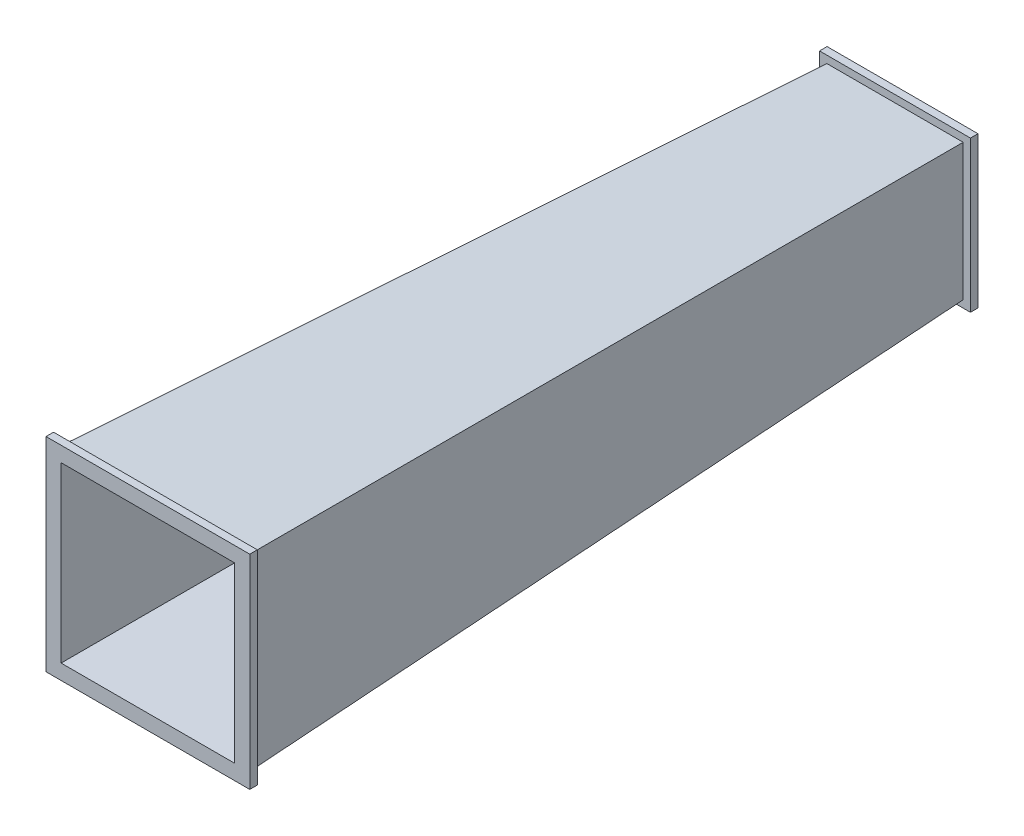
ISO-10303-21;
HEADER;
FILE_DESCRIPTION(('STEP AP214'),'2;1');
FILE_NAME('part.step','',(''),(''),'','','');
FILE_SCHEMA(('AUTOMOTIVE_DESIGN { 1 0 10303 214 1 1 1 1 }'));
ENDSEC;
DATA;
#1=APPLICATION_CONTEXT('core data for automotive mechanical design processes');
#2=APPLICATION_PROTOCOL_DEFINITION('international standard','automotive_design',2000,#1);
#3=PRODUCT_CONTEXT('',#1,'mechanical');
#4=PRODUCT('Part','Part','',(#3));
#5=PRODUCT_RELATED_PRODUCT_CATEGORY('part','',(#4));
#6=PRODUCT_DEFINITION_FORMATION('','',#4);
#7=PRODUCT_DEFINITION_CONTEXT('part definition',#1,'design');
#8=PRODUCT_DEFINITION('design','',#6,#7);
#9=PRODUCT_DEFINITION_SHAPE('','',#8);
#10=(LENGTH_UNIT() NAMED_UNIT(*) SI_UNIT(.MILLI.,.METRE.));
#11=(NAMED_UNIT(*) PLANE_ANGLE_UNIT() SI_UNIT($,.RADIAN.));
#12=(NAMED_UNIT(*) SI_UNIT($,.STERADIAN.) SOLID_ANGLE_UNIT());
#13=UNCERTAINTY_MEASURE_WITH_UNIT(LENGTH_MEASURE(1.E-05),#10,'distance_accuracy_value','');
#14=(GEOMETRIC_REPRESENTATION_CONTEXT(3) GLOBAL_UNCERTAINTY_ASSIGNED_CONTEXT((#13)) GLOBAL_UNIT_ASSIGNED_CONTEXT((#10,
#11,#12)) REPRESENTATION_CONTEXT('',''));
#15=CARTESIAN_POINT('',(0.,0.,0.));
#16=DIRECTION('',(0.,0.,1.));
#17=DIRECTION('',(1.,0.,0.));
#18=AXIS2_PLACEMENT_3D('',#15,#16,#17);
#19=CARTESIAN_POINT('',(44.9449424455043,0.,-1.57307298559265));
#20=DIRECTION('',(0.999388062160532,0.,-0.0349785821756186));
#21=DIRECTION('',(-0.0349785821756186,0.,-0.999388062160532));
#22=AXIS2_PLACEMENT_3D('',#19,#20,#21);
#23=PLANE('',#22);
#24=DIRECTION('',(-0.0349572036223083,-0.0349572036223083,-0.998777246351666));
#25=VECTOR('',#24,1.);
#26=CARTESIAN_POINT('',(62.5,62.5,500.));
#27=LINE('',#26,#25);
#28=CARTESIAN_POINT('',(62.325,62.325,495.));
#29=VERTEX_POINT('',#28);
#30=CARTESIAN_POINT('',(45.175,45.175,4.99999999999998));
#31=VERTEX_POINT('',#30);
#32=EDGE_CURVE('E55',#29,#31,#27,.T.);
#33=ORIENTED_EDGE('',*,*,#32,.F.);
#34=DIRECTION('',(0.,-1.,0.));
#35=VECTOR('',#34,1.);
#36=CARTESIAN_POINT('',(62.325,0.,495.));
#37=LINE('',#36,#35);
#38=CARTESIAN_POINT('',(62.325,-62.325,495.));
#39=VERTEX_POINT('',#38);
#40=EDGE_CURVE('E228',#29,#39,#37,.T.);
#41=ORIENTED_EDGE('',*,*,#40,.T.);
#42=DIRECTION('',(-0.0349572036223083,0.0349572036223083,-0.998777246351666));
#43=VECTOR('',#42,1.);
#44=CARTESIAN_POINT('',(62.5,-62.5,500.));
#45=LINE('',#44,#43);
#46=CARTESIAN_POINT('',(45.175,-45.175,4.99999999999998));
#47=VERTEX_POINT('',#46);
#48=EDGE_CURVE('E319',#39,#47,#45,.T.);
#49=ORIENTED_EDGE('',*,*,#48,.T.);
#50=DIRECTION('',(0.,1.,0.));
#51=VECTOR('',#50,1.);
#52=CARTESIAN_POINT('',(45.175,0.,5.));
#53=LINE('',#52,#51);
#54=EDGE_CURVE('E283',#47,#31,#53,.T.);
#55=ORIENTED_EDGE('',*,*,#54,.T.);
#56=EDGE_LOOP('',(#33,#41,#49,#55));
#57=FACE_BOUND('',#56,.T.);
#58=ADVANCED_FACE('F51',(#57),#23,.T.);
#59=CARTESIAN_POINT('',(0.,44.9449424455043,-1.57307298559265));
#60=DIRECTION('',(0.,0.999388062160532,-0.0349785821756186));
#61=DIRECTION('',(0.,0.0349785821756186,0.999388062160532));
#62=AXIS2_PLACEMENT_3D('',#59,#60,#61);
#63=PLANE('',#62);
#64=DIRECTION('',(0.0349572036223083,-0.0349572036223083,-0.998777246351666));
#65=VECTOR('',#64,1.);
#66=CARTESIAN_POINT('',(-62.5,62.5,500.));
#67=LINE('',#66,#65);
#68=CARTESIAN_POINT('',(-62.325,62.325,495.));
#69=VERTEX_POINT('',#68);
#70=CARTESIAN_POINT('',(-45.175,45.175,4.99999999999998));
#71=VERTEX_POINT('',#70);
#72=EDGE_CURVE('E338',#69,#71,#67,.T.);
#73=ORIENTED_EDGE('',*,*,#72,.F.);
#74=DIRECTION('',(1.,0.,0.));
#75=VECTOR('',#74,1.);
#76=CARTESIAN_POINT('',(0.,62.325,495.));
#77=LINE('',#76,#75);
#78=EDGE_CURVE('E70',#69,#29,#77,.T.);
#79=ORIENTED_EDGE('',*,*,#78,.T.);
#80=ORIENTED_EDGE('',*,*,#32,.T.);
#81=DIRECTION('',(-1.,0.,0.));
#82=VECTOR('',#81,1.);
#83=CARTESIAN_POINT('',(0.,45.175,5.));
#84=LINE('',#83,#82);
#85=EDGE_CURVE('E279',#31,#71,#84,.T.);
#86=ORIENTED_EDGE('',*,*,#85,.T.);
#87=EDGE_LOOP('',(#73,#79,#80,#86));
#88=FACE_BOUND('',#87,.T.);
#89=ADVANCED_FACE('F353',(#88),#63,.T.);
#90=CARTESIAN_POINT('',(0.,-44.9449424455043,-1.57307298559265));
#91=DIRECTION('',(0.,-0.999388062160532,-0.0349785821756186));
#92=DIRECTION('',(0.,0.0349785821756186,-0.999388062160532));
#93=AXIS2_PLACEMENT_3D('',#90,#91,#92);
#94=PLANE('',#93);
#95=ORIENTED_EDGE('',*,*,#48,.F.);
#96=DIRECTION('',(-1.,0.,0.));
#97=VECTOR('',#96,1.);
#98=CARTESIAN_POINT('',(0.,-62.325,495.));
#99=LINE('',#98,#97);
#100=CARTESIAN_POINT('',(-62.325,-62.325,495.));
#101=VERTEX_POINT('',#100);
#102=EDGE_CURVE('E218',#39,#101,#99,.T.);
#103=ORIENTED_EDGE('',*,*,#102,.T.);
#104=DIRECTION('',(0.0349572036223083,0.0349572036223083,-0.998777246351666));
#105=VECTOR('',#104,1.);
#106=CARTESIAN_POINT('',(-62.5,-62.5,500.));
#107=LINE('',#106,#105);
#108=CARTESIAN_POINT('',(-45.175,-45.175,4.99999999999998));
#109=VERTEX_POINT('',#108);
#110=EDGE_CURVE('E77',#101,#109,#107,.T.);
#111=ORIENTED_EDGE('',*,*,#110,.T.);
#112=DIRECTION('',(1.,0.,0.));
#113=VECTOR('',#112,1.);
#114=CARTESIAN_POINT('',(0.,-45.175,5.));
#115=LINE('',#114,#113);
#116=EDGE_CURVE('E268',#109,#47,#115,.T.);
#117=ORIENTED_EDGE('',*,*,#116,.T.);
#118=EDGE_LOOP('',(#95,#103,#111,#117));
#119=FACE_BOUND('',#118,.T.);
#120=ADVANCED_FACE('F364',(#119),#94,.T.);
#121=CARTESIAN_POINT('',(-44.9449424455043,0.,-1.57307298559265));
#122=DIRECTION('',(-0.999388062160532,0.,-0.0349785821756186));
#123=DIRECTION('',(-0.0349785821756186,0.,0.999388062160532));
#124=AXIS2_PLACEMENT_3D('',#121,#122,#123);
#125=PLANE('',#124);
#126=ORIENTED_EDGE('',*,*,#110,.F.);
#127=DIRECTION('',(0.,1.,0.));
#128=VECTOR('',#127,1.);
#129=CARTESIAN_POINT('',(-62.325,0.,495.));
#130=LINE('',#129,#128);
#131=EDGE_CURVE('E12',#101,#69,#130,.T.);
#132=ORIENTED_EDGE('',*,*,#131,.T.);
#133=ORIENTED_EDGE('',*,*,#72,.T.);
#134=DIRECTION('',(0.,-1.,0.));
#135=VECTOR('',#134,1.);
#136=CARTESIAN_POINT('',(-45.175,0.,5.));
#137=LINE('',#136,#135);
#138=EDGE_CURVE('E62',#71,#109,#137,.T.);
#139=ORIENTED_EDGE('',*,*,#138,.T.);
#140=EDGE_LOOP('',(#126,#132,#133,#139));
#141=FACE_BOUND('',#140,.T.);
#142=ADVANCED_FACE('F371',(#141),#125,.T.);
#143=CARTESIAN_POINT('',(0.,0.,0.));
#144=DIRECTION('',(0.,0.,1.));
#145=DIRECTION('',(1.,0.,0.));
#146=AXIS2_PLACEMENT_3D('',#143,#144,#145);
#147=PLANE('',#146);
#148=DIRECTION('',(1.,0.,0.));
#149=VECTOR('',#148,1.);
#150=CARTESIAN_POINT('',(0.,-39.9969384373166,0.));
#151=LINE('',#150,#149);
#152=CARTESIAN_POINT('',(-39.9969384373166,-39.9969384373166,0.));
#153=VERTEX_POINT('',#152);
#154=CARTESIAN_POINT('',(39.9969384373166,-39.9969384373166,0.));
#155=VERTEX_POINT('',#154);
#156=EDGE_CURVE('E307',#153,#155,#151,.T.);
#157=ORIENTED_EDGE('',*,*,#156,.T.);
#158=DIRECTION('',(0.,1.,0.));
#159=VECTOR('',#158,1.);
#160=CARTESIAN_POINT('',(39.9969384373166,0.,0.));
#161=LINE('',#160,#159);
#162=CARTESIAN_POINT('',(39.9969384373166,39.9969384373166,0.));
#163=VERTEX_POINT('',#162);
#164=EDGE_CURVE('E301',#155,#163,#161,.T.);
#165=ORIENTED_EDGE('',*,*,#164,.T.);
#166=DIRECTION('',(-1.,0.,0.));
#167=VECTOR('',#166,1.);
#168=CARTESIAN_POINT('',(0.,39.9969384373166,0.));
#169=LINE('',#168,#167);
#170=CARTESIAN_POINT('',(-39.9969384373166,39.9969384373166,0.));
#171=VERTEX_POINT('',#170);
#172=EDGE_CURVE('E315',#163,#171,#169,.T.);
#173=ORIENTED_EDGE('',*,*,#172,.T.);
#174=DIRECTION('',(0.,-1.,0.));
#175=VECTOR('',#174,1.);
#176=CARTESIAN_POINT('',(-39.9969384373166,0.,0.));
#177=LINE('',#176,#175);
#178=EDGE_CURVE('E311',#171,#153,#177,.T.);
#179=ORIENTED_EDGE('',*,*,#178,.T.);
#180=EDGE_LOOP('',(#157,#165,#173,#179));
#181=FACE_BOUND('',#180,.T.);
#182=DIRECTION('',(0.,1.,0.));
#183=VECTOR('',#182,1.);
#184=CARTESIAN_POINT('',(-50.,-50.,0.));
#185=LINE('',#184,#183);
#186=CARTESIAN_POINT('',(-50.,-50.,0.));
#187=VERTEX_POINT('',#186);
#188=CARTESIAN_POINT('',(-50.,50.,0.));
#189=VERTEX_POINT('',#188);
#190=EDGE_CURVE('E232',#187,#189,#185,.T.);
#191=ORIENTED_EDGE('',*,*,#190,.T.);
#192=DIRECTION('',(1.,0.,0.));
#193=VECTOR('',#192,1.);
#194=CARTESIAN_POINT('',(-50.,50.,0.));
#195=LINE('',#194,#193);
#196=CARTESIAN_POINT('',(50.,50.,0.));
#197=VERTEX_POINT('',#196);
#198=EDGE_CURVE('E254',#189,#197,#195,.T.);
#199=ORIENTED_EDGE('',*,*,#198,.T.);
#200=DIRECTION('',(0.,-1.,0.));
#201=VECTOR('',#200,1.);
#202=CARTESIAN_POINT('',(50.,50.,0.));
#203=LINE('',#202,#201);
#204=CARTESIAN_POINT('',(50.,-50.,0.));
#205=VERTEX_POINT('',#204);
#206=EDGE_CURVE('E258',#197,#205,#203,.T.);
#207=ORIENTED_EDGE('',*,*,#206,.T.);
#208=DIRECTION('',(-1.,0.,0.));
#209=VECTOR('',#208,1.);
#210=CARTESIAN_POINT('',(50.,-50.,0.));
#211=LINE('',#210,#209);
#212=EDGE_CURVE('E238',#205,#187,#211,.T.);
#213=ORIENTED_EDGE('',*,*,#212,.T.);
#214=EDGE_LOOP('',(#191,#199,#207,#213));
#215=FACE_BOUND('',#214,.T.);
#216=ADVANCED_FACE('F53',(#181,#215),#147,.F.);
#217=CARTESIAN_POINT('',(0.,0.,500.));
#218=DIRECTION('',(0.,0.,1.));
#219=DIRECTION('',(1.,0.,0.));
#220=AXIS2_PLACEMENT_3D('',#217,#218,#219);
#221=PLANE('',#220);
#222=DIRECTION('',(0.,1.,0.));
#223=VECTOR('',#222,1.);
#224=CARTESIAN_POINT('',(57.4969384373166,0.,500.));
#225=LINE('',#224,#223);
#226=CARTESIAN_POINT('',(57.4969384373166,-57.4969384373166,500.));
#227=VERTEX_POINT('',#226);
#228=CARTESIAN_POINT('',(57.4969384373166,57.4969384373166,500.));
#229=VERTEX_POINT('',#228);
#230=EDGE_CURVE('E287',#227,#229,#225,.T.);
#231=ORIENTED_EDGE('',*,*,#230,.F.);
#232=DIRECTION('',(1.,0.,0.));
#233=VECTOR('',#232,1.);
#234=CARTESIAN_POINT('',(0.,-57.4969384373166,500.));
#235=LINE('',#234,#233);
#236=CARTESIAN_POINT('',(-57.4969384373166,-57.4969384373166,500.));
#237=VERTEX_POINT('',#236);
#238=EDGE_CURVE('E323',#237,#227,#235,.T.);
#239=ORIENTED_EDGE('',*,*,#238,.F.);
#240=DIRECTION('',(0.,-1.,0.));
#241=VECTOR('',#240,1.);
#242=CARTESIAN_POINT('',(-57.4969384373166,0.,500.));
#243=LINE('',#242,#241);
#244=CARTESIAN_POINT('',(-57.4969384373166,57.4969384373166,500.));
#245=VERTEX_POINT('',#244);
#246=EDGE_CURVE('E326',#245,#237,#243,.T.);
#247=ORIENTED_EDGE('',*,*,#246,.F.);
#248=DIRECTION('',(-1.,0.,0.));
#249=VECTOR('',#248,1.);
#250=CARTESIAN_POINT('',(0.,57.4969384373166,500.));
#251=LINE('',#250,#249);
#252=EDGE_CURVE('E292',#229,#245,#251,.T.);
#253=ORIENTED_EDGE('',*,*,#252,.F.);
#254=EDGE_LOOP('',(#231,#239,#247,#253));
#255=FACE_BOUND('',#254,.T.);
#256=DIRECTION('',(1.,0.,0.));
#257=VECTOR('',#256,1.);
#258=CARTESIAN_POINT('',(0.,-67.5,500.));
#259=LINE('',#258,#257);
#260=CARTESIAN_POINT('',(-67.5,-67.5,500.));
#261=VERTEX_POINT('',#260);
#262=CARTESIAN_POINT('',(67.5,-67.5,500.));
#263=VERTEX_POINT('',#262);
#264=EDGE_CURVE('E208',#261,#263,#259,.T.);
#265=ORIENTED_EDGE('',*,*,#264,.T.);
#266=DIRECTION('',(0.,1.,0.));
#267=VECTOR('',#266,1.);
#268=CARTESIAN_POINT('',(67.5,0.,500.));
#269=LINE('',#268,#267);
#270=CARTESIAN_POINT('',(67.5,67.5,500.));
#271=VERTEX_POINT('',#270);
#272=EDGE_CURVE('E174',#263,#271,#269,.T.);
#273=ORIENTED_EDGE('',*,*,#272,.T.);
#274=DIRECTION('',(-1.,0.,0.));
#275=VECTOR('',#274,1.);
#276=CARTESIAN_POINT('',(0.,67.5,500.));
#277=LINE('',#276,#275);
#278=CARTESIAN_POINT('',(-67.5,67.5,500.));
#279=VERTEX_POINT('',#278);
#280=EDGE_CURVE('E201',#271,#279,#277,.T.);
#281=ORIENTED_EDGE('',*,*,#280,.T.);
#282=DIRECTION('',(0.,-1.,0.));
#283=VECTOR('',#282,1.);
#284=CARTESIAN_POINT('',(-67.5,0.,500.));
#285=LINE('',#284,#283);
#286=EDGE_CURVE('E197',#279,#261,#285,.T.);
#287=ORIENTED_EDGE('',*,*,#286,.T.);
#288=EDGE_LOOP('',(#265,#273,#281,#287));
#289=FACE_BOUND('',#288,.T.);
#290=ADVANCED_FACE('F367',(#255,#289),#221,.T.);
#291=CARTESIAN_POINT('',(39.9480021347016,0.,-1.39818007471455));
#292=DIRECTION('',(0.999388062160532,0.,-0.0349785821756186));
#293=DIRECTION('',(-0.0349785821756186,0.,-0.999388062160532));
#294=AXIS2_PLACEMENT_3D('',#291,#292,#293);
#295=PLANE('',#294);
#296=DIRECTION('',(-0.0349572036223083,0.0349572036223083,-0.998777246351666));
#297=VECTOR('',#296,1.);
#298=CARTESIAN_POINT('',(39.8991854330058,-39.8991854330057,-2.7929429803104));
#299=LINE('',#298,#297);
#300=EDGE_CURVE('E288',#227,#155,#299,.T.);
#301=ORIENTED_EDGE('',*,*,#300,.F.);
#302=ORIENTED_EDGE('',*,*,#230,.T.);
#303=DIRECTION('',(-0.0349572036223083,-0.0349572036223083,-0.998777246351666));
#304=VECTOR('',#303,1.);
#305=CARTESIAN_POINT('',(39.8991854330057,39.8991854330057,-2.7929429803104));
#306=LINE('',#305,#304);
#307=EDGE_CURVE('E291',#229,#163,#306,.T.);
#308=ORIENTED_EDGE('',*,*,#307,.T.);
#309=ORIENTED_EDGE('',*,*,#164,.F.);
#310=EDGE_LOOP('',(#301,#302,#308,#309));
#311=FACE_BOUND('',#310,.T.);
#312=ADVANCED_FACE('F415',(#311),#295,.F.);
#313=CARTESIAN_POINT('',(0.,39.9480021347016,-1.39818007471456));
#314=DIRECTION('',(0.,0.999388062160532,-0.0349785821756186));
#315=DIRECTION('',(0.,0.0349785821756186,0.999388062160532));
#316=AXIS2_PLACEMENT_3D('',#313,#314,#315);
#317=PLANE('',#316);
#318=ORIENTED_EDGE('',*,*,#307,.F.);
#319=ORIENTED_EDGE('',*,*,#252,.T.);
#320=DIRECTION('',(0.0349572036223083,-0.0349572036223083,-0.998777246351666));
#321=VECTOR('',#320,1.);
#322=CARTESIAN_POINT('',(-39.8991854330058,39.8991854330057,-2.7929429803104));
#323=LINE('',#322,#321);
#324=EDGE_CURVE('E297',#245,#171,#323,.T.);
#325=ORIENTED_EDGE('',*,*,#324,.T.);
#326=ORIENTED_EDGE('',*,*,#172,.F.);
#327=EDGE_LOOP('',(#318,#319,#325,#326));
#328=FACE_BOUND('',#327,.T.);
#329=ADVANCED_FACE('F418',(#328),#317,.F.);
#330=CARTESIAN_POINT('',(0.,-39.9480021347016,-1.39818007471456));
#331=DIRECTION('',(0.,-0.999388062160532,-0.0349785821756186));
#332=DIRECTION('',(0.,0.0349785821756186,-0.999388062160532));
#333=AXIS2_PLACEMENT_3D('',#330,#331,#332);
#334=PLANE('',#333);
#335=DIRECTION('',(0.0349572036223083,0.0349572036223083,-0.998777246351666));
#336=VECTOR('',#335,1.);
#337=CARTESIAN_POINT('',(-39.8991854330057,-39.8991854330057,-2.7929429803104));
#338=LINE('',#337,#336);
#339=EDGE_CURVE('E296',#237,#153,#338,.T.);
#340=ORIENTED_EDGE('',*,*,#339,.F.);
#341=ORIENTED_EDGE('',*,*,#238,.T.);
#342=ORIENTED_EDGE('',*,*,#300,.T.);
#343=ORIENTED_EDGE('',*,*,#156,.F.);
#344=EDGE_LOOP('',(#340,#341,#342,#343));
#345=FACE_BOUND('',#344,.T.);
#346=ADVANCED_FACE('F422',(#345),#334,.F.);
#347=CARTESIAN_POINT('',(-39.9480021347016,0.,-1.39818007471456));
#348=DIRECTION('',(-0.999388062160532,0.,-0.0349785821756186));
#349=DIRECTION('',(-0.0349785821756186,0.,0.999388062160532));
#350=AXIS2_PLACEMENT_3D('',#347,#348,#349);
#351=PLANE('',#350);
#352=ORIENTED_EDGE('',*,*,#324,.F.);
#353=ORIENTED_EDGE('',*,*,#246,.T.);
#354=ORIENTED_EDGE('',*,*,#339,.T.);
#355=ORIENTED_EDGE('',*,*,#178,.F.);
#356=EDGE_LOOP('',(#352,#353,#354,#355));
#357=FACE_BOUND('',#356,.T.);
#358=ADVANCED_FACE('F413',(#357),#351,.F.);
#359=CARTESIAN_POINT('',(-50.,-50.,5.));
#360=DIRECTION('',(-1.,0.,0.));
#361=DIRECTION('',(0.,0.,1.));
#362=AXIS2_PLACEMENT_3D('',#359,#360,#361);
#363=PLANE('',#362);
#364=ORIENTED_EDGE('',*,*,#190,.F.);
#365=DIRECTION('',(0.,0.,-1.));
#366=VECTOR('',#365,1.);
#367=CARTESIAN_POINT('',(-50.,-50.,5.));
#368=LINE('',#367,#366);
#369=CARTESIAN_POINT('',(-50.,-50.,5.));
#370=VERTEX_POINT('',#369);
#371=EDGE_CURVE('E265',#370,#187,#368,.T.);
#372=ORIENTED_EDGE('',*,*,#371,.F.);
#373=DIRECTION('',(0.,1.,0.));
#374=VECTOR('',#373,1.);
#375=CARTESIAN_POINT('',(-50.,-50.,5.));
#376=LINE('',#375,#374);
#377=CARTESIAN_POINT('',(-50.,50.,5.));
#378=VERTEX_POINT('',#377);
#379=EDGE_CURVE('E233',#370,#378,#376,.T.);
#380=ORIENTED_EDGE('',*,*,#379,.T.);
#381=DIRECTION('',(0.,0.,-1.));
#382=VECTOR('',#381,1.);
#383=CARTESIAN_POINT('',(-50.,50.,5.));
#384=LINE('',#383,#382);
#385=EDGE_CURVE('E250',#378,#189,#384,.T.);
#386=ORIENTED_EDGE('',*,*,#385,.T.);
#387=EDGE_LOOP('',(#364,#372,#380,#386));
#388=FACE_BOUND('',#387,.T.);
#389=ADVANCED_FACE('F403',(#388),#363,.T.);
#390=CARTESIAN_POINT('',(50.,-50.,5.));
#391=DIRECTION('',(0.,-1.,0.));
#392=DIRECTION('',(0.,0.,-1.));
#393=AXIS2_PLACEMENT_3D('',#390,#391,#392);
#394=PLANE('',#393);
#395=ORIENTED_EDGE('',*,*,#212,.F.);
#396=DIRECTION('',(0.,0.,-1.));
#397=VECTOR('',#396,1.);
#398=CARTESIAN_POINT('',(50.,-50.,5.));
#399=LINE('',#398,#397);
#400=CARTESIAN_POINT('',(50.,-50.,5.));
#401=VERTEX_POINT('',#400);
#402=EDGE_CURVE('E269',#401,#205,#399,.T.);
#403=ORIENTED_EDGE('',*,*,#402,.F.);
#404=DIRECTION('',(-1.,0.,0.));
#405=VECTOR('',#404,1.);
#406=CARTESIAN_POINT('',(50.,-50.,5.));
#407=LINE('',#406,#405);
#408=EDGE_CURVE('E246',#401,#370,#407,.T.);
#409=ORIENTED_EDGE('',*,*,#408,.T.);
#410=ORIENTED_EDGE('',*,*,#371,.T.);
#411=EDGE_LOOP('',(#395,#403,#409,#410));
#412=FACE_BOUND('',#411,.T.);
#413=ADVANCED_FACE('F399',(#412),#394,.T.);
#414=CARTESIAN_POINT('',(50.,50.,5.));
#415=DIRECTION('',(1.,0.,0.));
#416=DIRECTION('',(0.,0.,-1.));
#417=AXIS2_PLACEMENT_3D('',#414,#415,#416);
#418=PLANE('',#417);
#419=ORIENTED_EDGE('',*,*,#206,.F.);
#420=DIRECTION('',(0.,0.,-1.));
#421=VECTOR('',#420,1.);
#422=CARTESIAN_POINT('',(50.,50.,5.));
#423=LINE('',#422,#421);
#424=CARTESIAN_POINT('',(50.,50.,5.));
#425=VERTEX_POINT('',#424);
#426=EDGE_CURVE('E272',#425,#197,#423,.T.);
#427=ORIENTED_EDGE('',*,*,#426,.F.);
#428=DIRECTION('',(0.,-1.,0.));
#429=VECTOR('',#428,1.);
#430=CARTESIAN_POINT('',(50.,50.,5.));
#431=LINE('',#430,#429);
#432=EDGE_CURVE('E242',#425,#401,#431,.T.);
#433=ORIENTED_EDGE('',*,*,#432,.T.);
#434=ORIENTED_EDGE('',*,*,#402,.T.);
#435=EDGE_LOOP('',(#419,#427,#433,#434));
#436=FACE_BOUND('',#435,.T.);
#437=ADVANCED_FACE('F402',(#436),#418,.T.);
#438=CARTESIAN_POINT('',(-50.,50.,5.));
#439=DIRECTION('',(0.,1.,0.));
#440=DIRECTION('',(0.,0.,1.));
#441=AXIS2_PLACEMENT_3D('',#438,#439,#440);
#442=PLANE('',#441);
#443=ORIENTED_EDGE('',*,*,#198,.F.);
#444=ORIENTED_EDGE('',*,*,#385,.F.);
#445=DIRECTION('',(1.,0.,0.));
#446=VECTOR('',#445,1.);
#447=CARTESIAN_POINT('',(-50.,50.,5.));
#448=LINE('',#447,#446);
#449=EDGE_CURVE('E237',#378,#425,#448,.T.);
#450=ORIENTED_EDGE('',*,*,#449,.T.);
#451=ORIENTED_EDGE('',*,*,#426,.T.);
#452=EDGE_LOOP('',(#443,#444,#450,#451));
#453=FACE_BOUND('',#452,.T.);
#454=ADVANCED_FACE('F398',(#453),#442,.T.);
#455=CARTESIAN_POINT('',(0.,0.,5.));
#456=DIRECTION('',(0.,0.,-1.));
#457=DIRECTION('',(-1.,0.,0.));
#458=AXIS2_PLACEMENT_3D('',#455,#456,#457);
#459=PLANE('',#458);
#460=ORIENTED_EDGE('',*,*,#54,.F.);
#461=ORIENTED_EDGE('',*,*,#116,.F.);
#462=ORIENTED_EDGE('',*,*,#138,.F.);
#463=ORIENTED_EDGE('',*,*,#85,.F.);
#464=EDGE_LOOP('',(#460,#461,#462,#463));
#465=FACE_BOUND('',#464,.T.);
#466=ORIENTED_EDGE('',*,*,#379,.F.);
#467=ORIENTED_EDGE('',*,*,#408,.F.);
#468=ORIENTED_EDGE('',*,*,#432,.F.);
#469=ORIENTED_EDGE('',*,*,#449,.F.);
#470=EDGE_LOOP('',(#466,#467,#468,#469));
#471=FACE_BOUND('',#470,.T.);
#472=ADVANCED_FACE('F356',(#465,#471),#459,.F.);
#473=CARTESIAN_POINT('',(0.,-67.5,495.));
#474=DIRECTION('',(0.,-1.,0.));
#475=DIRECTION('',(0.,0.,-1.));
#476=AXIS2_PLACEMENT_3D('',#473,#474,#475);
#477=PLANE('',#476);
#478=ORIENTED_EDGE('',*,*,#264,.F.);
#479=DIRECTION('',(0.,0.,1.));
#480=VECTOR('',#479,1.);
#481=CARTESIAN_POINT('',(-67.5,-67.5,495.));
#482=LINE('',#481,#480);
#483=CARTESIAN_POINT('',(-67.5,-67.5,495.));
#484=VERTEX_POINT('',#483);
#485=EDGE_CURVE('E195',#484,#261,#482,.T.);
#486=ORIENTED_EDGE('',*,*,#485,.F.);
#487=DIRECTION('',(1.,0.,0.));
#488=VECTOR('',#487,1.);
#489=CARTESIAN_POINT('',(0.,-67.5,495.));
#490=LINE('',#489,#488);
#491=CARTESIAN_POINT('',(67.5,-67.5,495.));
#492=VERTEX_POINT('',#491);
#493=EDGE_CURVE('E188',#484,#492,#490,.T.);
#494=ORIENTED_EDGE('',*,*,#493,.T.);
#495=DIRECTION('',(0.,0.,1.));
#496=VECTOR('',#495,1.);
#497=CARTESIAN_POINT('',(67.5,-67.5,495.));
#498=LINE('',#497,#496);
#499=EDGE_CURVE('E169',#492,#263,#498,.T.);
#500=ORIENTED_EDGE('',*,*,#499,.T.);
#501=EDGE_LOOP('',(#478,#486,#494,#500));
#502=FACE_BOUND('',#501,.T.);
#503=ADVANCED_FACE('F194',(#502),#477,.T.);
#504=CARTESIAN_POINT('',(-67.5,0.,495.));
#505=DIRECTION('',(-1.,0.,0.));
#506=DIRECTION('',(0.,0.,1.));
#507=AXIS2_PLACEMENT_3D('',#504,#505,#506);
#508=PLANE('',#507);
#509=ORIENTED_EDGE('',*,*,#286,.F.);
#510=DIRECTION('',(0.,0.,1.));
#511=VECTOR('',#510,1.);
#512=CARTESIAN_POINT('',(-67.5,67.5,495.));
#513=LINE('',#512,#511);
#514=CARTESIAN_POINT('',(-67.5,67.5,495.));
#515=VERTEX_POINT('',#514);
#516=EDGE_CURVE('E219',#515,#279,#513,.T.);
#517=ORIENTED_EDGE('',*,*,#516,.F.);
#518=DIRECTION('',(0.,-1.,0.));
#519=VECTOR('',#518,1.);
#520=CARTESIAN_POINT('',(-67.5,0.,495.));
#521=LINE('',#520,#519);
#522=EDGE_CURVE('E181',#515,#484,#521,.T.);
#523=ORIENTED_EDGE('',*,*,#522,.T.);
#524=ORIENTED_EDGE('',*,*,#485,.T.);
#525=EDGE_LOOP('',(#509,#517,#523,#524));
#526=FACE_BOUND('',#525,.T.);
#527=ADVANCED_FACE('F387',(#526),#508,.T.);
#528=CARTESIAN_POINT('',(0.,67.5,495.));
#529=DIRECTION('',(0.,1.,0.));
#530=DIRECTION('',(0.,0.,1.));
#531=AXIS2_PLACEMENT_3D('',#528,#529,#530);
#532=PLANE('',#531);
#533=ORIENTED_EDGE('',*,*,#280,.F.);
#534=DIRECTION('',(0.,0.,1.));
#535=VECTOR('',#534,1.);
#536=CARTESIAN_POINT('',(67.5,67.5,495.));
#537=LINE('',#536,#535);
#538=CARTESIAN_POINT('',(67.5,67.5,495.));
#539=VERTEX_POINT('',#538);
#540=EDGE_CURVE('E180',#539,#271,#537,.T.);
#541=ORIENTED_EDGE('',*,*,#540,.F.);
#542=DIRECTION('',(-1.,0.,0.));
#543=VECTOR('',#542,1.);
#544=CARTESIAN_POINT('',(0.,67.5,495.));
#545=LINE('',#544,#543);
#546=EDGE_CURVE('E191',#539,#515,#545,.T.);
#547=ORIENTED_EDGE('',*,*,#546,.T.);
#548=ORIENTED_EDGE('',*,*,#516,.T.);
#549=EDGE_LOOP('',(#533,#541,#547,#548));
#550=FACE_BOUND('',#549,.T.);
#551=ADVANCED_FACE('F384',(#550),#532,.T.);
#552=CARTESIAN_POINT('',(67.5,0.,495.));
#553=DIRECTION('',(1.,0.,0.));
#554=DIRECTION('',(0.,0.,-1.));
#555=AXIS2_PLACEMENT_3D('',#552,#553,#554);
#556=PLANE('',#555);
#557=ORIENTED_EDGE('',*,*,#272,.F.);
#558=ORIENTED_EDGE('',*,*,#499,.F.);
#559=DIRECTION('',(0.,1.,0.));
#560=VECTOR('',#559,1.);
#561=CARTESIAN_POINT('',(67.5,0.,495.));
#562=LINE('',#561,#560);
#563=EDGE_CURVE('E172',#492,#539,#562,.T.);
#564=ORIENTED_EDGE('',*,*,#563,.T.);
#565=ORIENTED_EDGE('',*,*,#540,.T.);
#566=EDGE_LOOP('',(#557,#558,#564,#565));
#567=FACE_BOUND('',#566,.T.);
#568=ADVANCED_FACE('F171',(#567),#556,.T.);
#569=CARTESIAN_POINT('',(0.,0.,495.));
#570=DIRECTION('',(0.,0.,1.));
#571=DIRECTION('',(1.,0.,0.));
#572=AXIS2_PLACEMENT_3D('',#569,#570,#571);
#573=PLANE('',#572);
#574=ORIENTED_EDGE('',*,*,#40,.F.);
#575=ORIENTED_EDGE('',*,*,#78,.F.);
#576=ORIENTED_EDGE('',*,*,#131,.F.);
#577=ORIENTED_EDGE('',*,*,#102,.F.);
#578=EDGE_LOOP('',(#574,#575,#576,#577));
#579=FACE_BOUND('',#578,.T.);
#580=ORIENTED_EDGE('',*,*,#493,.F.);
#581=ORIENTED_EDGE('',*,*,#522,.F.);
#582=ORIENTED_EDGE('',*,*,#546,.F.);
#583=ORIENTED_EDGE('',*,*,#563,.F.);
#584=EDGE_LOOP('',(#580,#581,#582,#583));
#585=FACE_BOUND('',#584,.T.);
#586=ADVANCED_FACE('F186',(#579,#585),#573,.F.);
#587=CLOSED_SHELL('',(#58,#89,#120,#142,#216,#290,#312,#329,#346,#358,#389,#413,#437,#454,#472,
#503,#527,#551,#568,#586));
#588=MANIFOLD_SOLID_BREP('B2',#587);
#589=ADVANCED_BREP_SHAPE_REPRESENTATION('',(#18,#588),#14);
#590=SHAPE_DEFINITION_REPRESENTATION(#9,#589);
ENDSEC;
END-ISO-10303-21;
